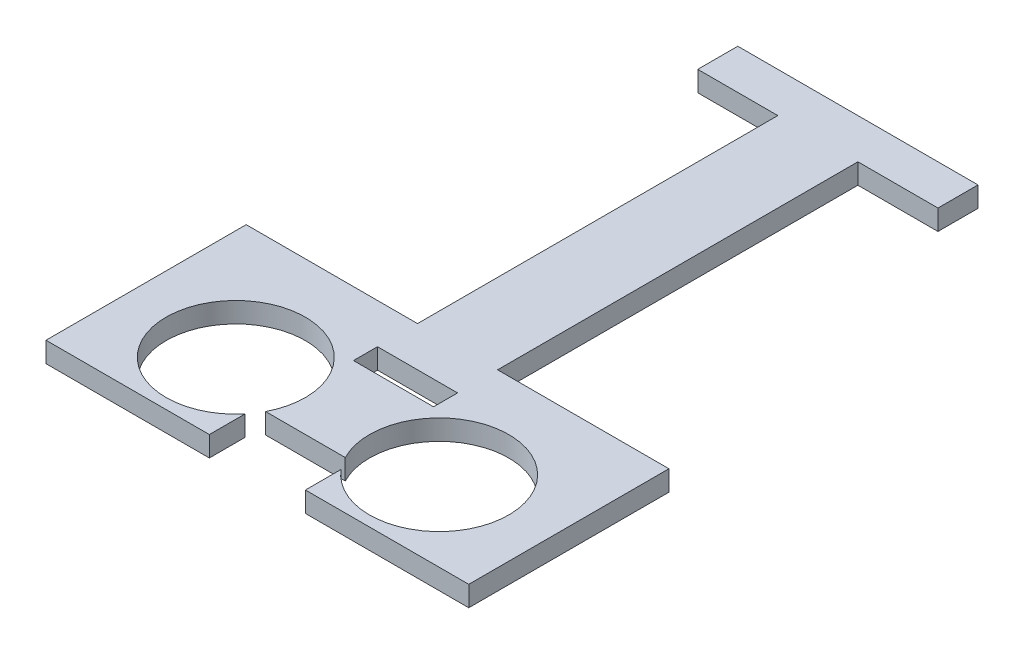
ISO-10303-21;
HEADER;
FILE_DESCRIPTION(('STEP AP214'),'2;1');
FILE_NAME('part.step','',(''),(''),'','','');
FILE_SCHEMA(('AUTOMOTIVE_DESIGN { 1 0 10303 214 1 1 1 1 }'));
ENDSEC;
DATA;
#1=APPLICATION_CONTEXT('core data for automotive mechanical design processes');
#2=APPLICATION_PROTOCOL_DEFINITION('international standard','automotive_design',2000,#1);
#3=PRODUCT_CONTEXT('',#1,'mechanical');
#4=PRODUCT('Part','Part','',(#3));
#5=PRODUCT_RELATED_PRODUCT_CATEGORY('part','',(#4));
#6=PRODUCT_DEFINITION_FORMATION('','',#4);
#7=PRODUCT_DEFINITION_CONTEXT('part definition',#1,'design');
#8=PRODUCT_DEFINITION('design','',#6,#7);
#9=PRODUCT_DEFINITION_SHAPE('','',#8);
#10=(LENGTH_UNIT() NAMED_UNIT(*) SI_UNIT(.MILLI.,.METRE.));
#11=(NAMED_UNIT(*) PLANE_ANGLE_UNIT() SI_UNIT($,.RADIAN.));
#12=(NAMED_UNIT(*) SI_UNIT($,.STERADIAN.) SOLID_ANGLE_UNIT());
#13=UNCERTAINTY_MEASURE_WITH_UNIT(LENGTH_MEASURE(1.E-05),#10,'distance_accuracy_value','');
#14=(GEOMETRIC_REPRESENTATION_CONTEXT(3) GLOBAL_UNCERTAINTY_ASSIGNED_CONTEXT((#13)) GLOBAL_UNIT_ASSIGNED_CONTEXT((#10,
#11,#12)) REPRESENTATION_CONTEXT('',''));
#15=CARTESIAN_POINT('',(0.,0.,0.));
#16=DIRECTION('',(0.,0.,1.));
#17=DIRECTION('',(1.,0.,0.));
#18=AXIS2_PLACEMENT_3D('',#15,#16,#17);
#19=CARTESIAN_POINT('',(0.,2.54,-24.8997702626595));
#20=DIRECTION('',(0.,0.,-1.));
#21=DIRECTION('',(-1.,0.,0.));
#22=AXIS2_PLACEMENT_3D('',#19,#20,#21);
#23=PLANE('',#22);
#24=DIRECTION('',(1.,0.,0.));
#25=VECTOR('',#24,1.);
#26=CARTESIAN_POINT('',(0.,0.,-24.8997702626595));
#27=LINE('',#26,#25);
#28=CARTESIAN_POINT('',(-12.7518412006876,0.,-24.8997702626595));
#29=VERTEX_POINT('',#28);
#30=CARTESIAN_POINT('',(-2.75184120068759,0.,-24.8997702626595));
#31=VERTEX_POINT('',#30);
#32=EDGE_CURVE('E248',#29,#31,#27,.T.);
#33=ORIENTED_EDGE('',*,*,#32,.T.);
#34=DIRECTION('',(0.,-1.,0.));
#35=VECTOR('',#34,1.);
#36=CARTESIAN_POINT('',(-2.75184120068759,2.54,-24.8997702626595));
#37=LINE('',#36,#35);
#38=CARTESIAN_POINT('',(-2.75184120068759,2.54,-24.8997702626595));
#39=VERTEX_POINT('',#38);
#40=EDGE_CURVE('E11',#39,#31,#37,.T.);
#41=ORIENTED_EDGE('',*,*,#40,.F.);
#42=DIRECTION('',(1.,0.,0.));
#43=VECTOR('',#42,1.);
#44=CARTESIAN_POINT('',(0.,2.54,-24.8997702626595));
#45=LINE('',#44,#43);
#46=CARTESIAN_POINT('',(-12.7518412006876,2.54,-24.8997702626595));
#47=VERTEX_POINT('',#46);
#48=EDGE_CURVE('E680',#47,#39,#45,.T.);
#49=ORIENTED_EDGE('',*,*,#48,.F.);
#50=DIRECTION('',(0.,-1.,0.));
#51=VECTOR('',#50,1.);
#52=CARTESIAN_POINT('',(-12.7518412006876,2.54,-24.8997702626595));
#53=LINE('',#52,#51);
#54=EDGE_CURVE('E61',#47,#29,#53,.T.);
#55=ORIENTED_EDGE('',*,*,#54,.T.);
#56=EDGE_LOOP('',(#33,#41,#49,#55));
#57=FACE_BOUND('',#56,.T.);
#58=ADVANCED_FACE('F41',(#57),#23,.F.);
#59=CARTESIAN_POINT('',(-2.75184120068758,2.54,0.));
#60=DIRECTION('',(1.,0.,0.));
#61=DIRECTION('',(0.,0.,-1.));
#62=AXIS2_PLACEMENT_3D('',#59,#60,#61);
#63=PLANE('',#62);
#64=DIRECTION('',(0.,0.,1.));
#65=VECTOR('',#64,1.);
#66=CARTESIAN_POINT('',(-2.75184120068758,0.,0.));
#67=LINE('',#66,#65);
#68=CARTESIAN_POINT('',(-2.75184120068758,0.,20.1002297373405));
#69=VERTEX_POINT('',#68);
#70=EDGE_CURVE('E251',#31,#69,#67,.T.);
#71=ORIENTED_EDGE('',*,*,#70,.T.);
#72=DIRECTION('',(0.,-1.,0.));
#73=VECTOR('',#72,1.);
#74=CARTESIAN_POINT('',(-2.75184120068758,2.54,20.1002297373405));
#75=LINE('',#74,#73);
#76=CARTESIAN_POINT('',(-2.75184120068758,2.54,20.1002297373405));
#77=VERTEX_POINT('',#76);
#78=EDGE_CURVE('E52',#77,#69,#75,.T.);
#79=ORIENTED_EDGE('',*,*,#78,.F.);
#80=DIRECTION('',(0.,0.,1.));
#81=VECTOR('',#80,1.);
#82=CARTESIAN_POINT('',(-2.75184120068758,2.54,0.));
#83=LINE('',#82,#81);
#84=EDGE_CURVE('E686',#39,#77,#83,.T.);
#85=ORIENTED_EDGE('',*,*,#84,.F.);
#86=ORIENTED_EDGE('',*,*,#40,.T.);
#87=EDGE_LOOP('',(#71,#79,#85,#86));
#88=FACE_BOUND('',#87,.T.);
#89=ADVANCED_FACE('F389',(#88),#63,.F.);
#90=CARTESIAN_POINT('',(0.,2.54,20.1002297373405));
#91=DIRECTION('',(0.,0.,-1.));
#92=DIRECTION('',(-1.,0.,0.));
#93=AXIS2_PLACEMENT_3D('',#90,#91,#92);
#94=PLANE('',#93);
#95=DIRECTION('',(1.,0.,0.));
#96=VECTOR('',#95,1.);
#97=CARTESIAN_POINT('',(0.,0.,20.1002297373405));
#98=LINE('',#97,#96);
#99=CARTESIAN_POINT('',(-24.1518412006876,0.,20.1002297373405));
#100=VERTEX_POINT('',#99);
#101=EDGE_CURVE('E256',#100,#69,#98,.T.);
#102=ORIENTED_EDGE('',*,*,#101,.F.);
#103=DIRECTION('',(0.,-1.,0.));
#104=VECTOR('',#103,1.);
#105=CARTESIAN_POINT('',(-24.1518412006876,2.54,20.1002297373405));
#106=LINE('',#105,#104);
#107=CARTESIAN_POINT('',(-24.1518412006876,2.54,20.1002297373405));
#108=VERTEX_POINT('',#107);
#109=EDGE_CURVE('E347',#108,#100,#106,.T.);
#110=ORIENTED_EDGE('',*,*,#109,.F.);
#111=DIRECTION('',(1.,0.,0.));
#112=VECTOR('',#111,1.);
#113=CARTESIAN_POINT('',(0.,2.54,20.1002297373405));
#114=LINE('',#113,#112);
#115=EDGE_CURVE('E651',#108,#77,#114,.T.);
#116=ORIENTED_EDGE('',*,*,#115,.T.);
#117=ORIENTED_EDGE('',*,*,#78,.T.);
#118=EDGE_LOOP('',(#102,#110,#116,#117));
#119=FACE_BOUND('',#118,.T.);
#120=ADVANCED_FACE('F395',(#119),#94,.T.);
#121=CARTESIAN_POINT('',(-24.1518412006876,2.54,0.));
#122=DIRECTION('',(1.,0.,0.));
#123=DIRECTION('',(0.,0.,-1.));
#124=AXIS2_PLACEMENT_3D('',#121,#122,#123);
#125=PLANE('',#124);
#126=DIRECTION('',(0.,0.,1.));
#127=VECTOR('',#126,1.);
#128=CARTESIAN_POINT('',(-24.1518412006876,0.,0.));
#129=LINE('',#128,#127);
#130=CARTESIAN_POINT('',(-24.1518412006876,0.,45.1002297373405));
#131=VERTEX_POINT('',#130);
#132=EDGE_CURVE('E260',#100,#131,#129,.T.);
#133=ORIENTED_EDGE('',*,*,#132,.T.);
#134=DIRECTION('',(0.,-1.,0.));
#135=VECTOR('',#134,1.);
#136=CARTESIAN_POINT('',(-24.1518412006876,2.54,45.1002297373405));
#137=LINE('',#136,#135);
#138=CARTESIAN_POINT('',(-24.1518412006876,2.54,45.1002297373405));
#139=VERTEX_POINT('',#138);
#140=EDGE_CURVE('E343',#139,#131,#137,.T.);
#141=ORIENTED_EDGE('',*,*,#140,.F.);
#142=DIRECTION('',(0.,0.,1.));
#143=VECTOR('',#142,1.);
#144=CARTESIAN_POINT('',(-24.1518412006876,2.54,0.));
#145=LINE('',#144,#143);
#146=EDGE_CURVE('E644',#108,#139,#145,.T.);
#147=ORIENTED_EDGE('',*,*,#146,.F.);
#148=ORIENTED_EDGE('',*,*,#109,.T.);
#149=EDGE_LOOP('',(#133,#141,#147,#148));
#150=FACE_BOUND('',#149,.T.);
#151=ADVANCED_FACE('F593',(#150),#125,.F.);
#152=CARTESIAN_POINT('',(0.,2.54,45.1002297373405));
#153=DIRECTION('',(0.,0.,-1.));
#154=DIRECTION('',(-1.,0.,0.));
#155=AXIS2_PLACEMENT_3D('',#152,#153,#154);
#156=PLANE('',#155);
#157=DIRECTION('',(1.,0.,0.));
#158=VECTOR('',#157,1.);
#159=CARTESIAN_POINT('',(0.,0.,45.1002297373405));
#160=LINE('',#159,#158);
#161=CARTESIAN_POINT('',(-3.75184120068757,0.,45.1002297373405));
#162=VERTEX_POINT('',#161);
#163=EDGE_CURVE('E264',#131,#162,#160,.T.);
#164=ORIENTED_EDGE('',*,*,#163,.T.);
#165=DIRECTION('',(0.,-1.,0.));
#166=VECTOR('',#165,1.);
#167=CARTESIAN_POINT('',(-3.75184120068757,2.54,45.1002297373405));
#168=LINE('',#167,#166);
#169=CARTESIAN_POINT('',(-3.75184120068757,2.54,45.1002297373405));
#170=VERTEX_POINT('',#169);
#171=EDGE_CURVE('E340',#170,#162,#168,.T.);
#172=ORIENTED_EDGE('',*,*,#171,.F.);
#173=DIRECTION('',(1.,0.,0.));
#174=VECTOR('',#173,1.);
#175=CARTESIAN_POINT('',(0.,2.54,45.1002297373405));
#176=LINE('',#175,#174);
#177=EDGE_CURVE('E639',#139,#170,#176,.T.);
#178=ORIENTED_EDGE('',*,*,#177,.F.);
#179=ORIENTED_EDGE('',*,*,#140,.T.);
#180=EDGE_LOOP('',(#164,#172,#178,#179));
#181=FACE_BOUND('',#180,.T.);
#182=ADVANCED_FACE('F536',(#181),#156,.F.);
#183=CARTESIAN_POINT('',(-3.75184120068757,2.54,0.));
#184=DIRECTION('',(1.,0.,0.));
#185=DIRECTION('',(0.,0.,-1.));
#186=AXIS2_PLACEMENT_3D('',#183,#184,#185);
#187=PLANE('',#186);
#188=DIRECTION('',(0.,0.,1.));
#189=VECTOR('',#188,1.);
#190=CARTESIAN_POINT('',(-3.75184120068757,0.,0.));
#191=LINE('',#190,#189);
#192=CARTESIAN_POINT('',(-3.75184120068757,0.,40.6500045075452));
#193=VERTEX_POINT('',#192);
#194=EDGE_CURVE('E268',#193,#162,#191,.T.);
#195=ORIENTED_EDGE('',*,*,#194,.F.);
#196=DIRECTION('',(0.,-1.,0.));
#197=VECTOR('',#196,1.);
#198=CARTESIAN_POINT('',(-3.75184120068757,2.54,40.6500045075452));
#199=LINE('',#198,#197);
#200=CARTESIAN_POINT('',(-3.75184120068757,2.54,40.6500045075452));
#201=VERTEX_POINT('',#200);
#202=EDGE_CURVE('E337',#201,#193,#199,.T.);
#203=ORIENTED_EDGE('',*,*,#202,.F.);
#204=DIRECTION('',(0.,0.,1.));
#205=VECTOR('',#204,1.);
#206=CARTESIAN_POINT('',(-3.75184120068757,2.54,0.));
#207=LINE('',#206,#205);
#208=EDGE_CURVE('E643',#201,#170,#207,.T.);
#209=ORIENTED_EDGE('',*,*,#208,.T.);
#210=ORIENTED_EDGE('',*,*,#171,.T.);
#211=EDGE_LOOP('',(#195,#203,#209,#210));
#212=FACE_BOUND('',#211,.T.);
#213=ADVANCED_FACE('F574',(#212),#187,.T.);
#214=CARTESIAN_POINT('',(-10.4518412006876,2.54,35.1002297373405));
#215=DIRECTION('',(0.,-1.,0.));
#216=DIRECTION('',(0.,0.,-1.));
#217=AXIS2_PLACEMENT_3D('',#214,#215,#216);
#218=CYLINDRICAL_SURFACE('',#217,8.7);
#219=CARTESIAN_POINT('',(-10.4518412006876,0.,35.1002297373405));
#220=DIRECTION('',(0.,1.,0.));
#221=DIRECTION('',(0.,0.,1.));
#222=AXIS2_PLACEMENT_3D('',#219,#220,#221);
#223=CIRCLE('',#222,8.7);
#224=CARTESIAN_POINT('',(-2.72591083600009,0.,39.1002297373405));
#225=VERTEX_POINT('',#224);
#226=EDGE_CURVE('E273',#225,#193,#223,.T.);
#227=ORIENTED_EDGE('',*,*,#226,.F.);
#228=DIRECTION('',(0.,-1.,0.));
#229=VECTOR('',#228,1.);
#230=CARTESIAN_POINT('',(-2.72591083600009,2.54,39.1002297373405));
#231=LINE('',#230,#229);
#232=CARTESIAN_POINT('',(-2.72591083600009,2.54,39.1002297373405));
#233=VERTEX_POINT('',#232);
#234=EDGE_CURVE('E334',#233,#225,#231,.T.);
#235=ORIENTED_EDGE('',*,*,#234,.F.);
#236=CARTESIAN_POINT('',(-10.4518412006876,2.54,35.1002297373405));
#237=DIRECTION('',(0.,1.,0.));
#238=DIRECTION('',(0.,0.,1.));
#239=AXIS2_PLACEMENT_3D('',#236,#237,#238);
#240=CIRCLE('',#239,8.7);
#241=EDGE_CURVE('E649',#233,#201,#240,.T.);
#242=ORIENTED_EDGE('',*,*,#241,.T.);
#243=ORIENTED_EDGE('',*,*,#202,.T.);
#244=EDGE_LOOP('',(#227,#235,#242,#243));
#245=FACE_BOUND('',#244,.T.);
#246=ADVANCED_FACE('F564',(#245),#218,.F.);
#247=CARTESIAN_POINT('',(0.,2.54,39.1002297373405));
#248=DIRECTION('',(0.,0.,-1.));
#249=DIRECTION('',(-1.,0.,0.));
#250=AXIS2_PLACEMENT_3D('',#247,#248,#249);
#251=PLANE('',#250);
#252=DIRECTION('',(1.,0.,0.));
#253=VECTOR('',#252,1.);
#254=CARTESIAN_POINT('',(0.,0.,39.1002297373405));
#255=LINE('',#254,#253);
#256=CARTESIAN_POINT('',(7.22222843462496,0.,39.1002297373405));
#257=VERTEX_POINT('',#256);
#258=EDGE_CURVE('E277',#225,#257,#255,.T.);
#259=ORIENTED_EDGE('',*,*,#258,.T.);
#260=DIRECTION('',(0.,-1.,0.));
#261=VECTOR('',#260,1.);
#262=CARTESIAN_POINT('',(7.22222843462496,2.54,39.1002297373405));
#263=LINE('',#262,#261);
#264=CARTESIAN_POINT('',(7.22222843462496,2.54,39.1002297373405));
#265=VERTEX_POINT('',#264);
#266=EDGE_CURVE('E331',#265,#257,#263,.T.);
#267=ORIENTED_EDGE('',*,*,#266,.F.);
#268=DIRECTION('',(1.,0.,0.));
#269=VECTOR('',#268,1.);
#270=CARTESIAN_POINT('',(0.,2.54,39.1002297373405));
#271=LINE('',#270,#269);
#272=EDGE_CURVE('E671',#233,#265,#271,.T.);
#273=ORIENTED_EDGE('',*,*,#272,.F.);
#274=ORIENTED_EDGE('',*,*,#234,.T.);
#275=EDGE_LOOP('',(#259,#267,#273,#274));
#276=FACE_BOUND('',#275,.T.);
#277=ADVANCED_FACE('F554',(#276),#251,.F.);
#278=CARTESIAN_POINT('',(14.9481587993124,2.54,35.1002297373405));
#279=DIRECTION('',(0.,-1.,0.));
#280=DIRECTION('',(0.,0.,-1.));
#281=AXIS2_PLACEMENT_3D('',#278,#279,#280);
#282=CYLINDRICAL_SURFACE('',#281,8.7);
#283=CARTESIAN_POINT('',(14.9481587993124,0.,35.1002297373405));
#284=DIRECTION('',(0.,1.,0.));
#285=DIRECTION('',(0.,0.,1.));
#286=AXIS2_PLACEMENT_3D('',#283,#284,#285);
#287=CIRCLE('',#286,8.7);
#288=CARTESIAN_POINT('',(8.24815879931243,0.,40.6500045075451));
#289=VERTEX_POINT('',#288);
#290=EDGE_CURVE('E281',#289,#257,#287,.T.);
#291=ORIENTED_EDGE('',*,*,#290,.F.);
#292=DIRECTION('',(0.,-1.,0.));
#293=VECTOR('',#292,1.);
#294=CARTESIAN_POINT('',(8.24815879931243,2.54,40.6500045075451));
#295=LINE('',#294,#293);
#296=CARTESIAN_POINT('',(8.24815879931243,2.54,40.6500045075451));
#297=VERTEX_POINT('',#296);
#298=EDGE_CURVE('E328',#297,#289,#295,.T.);
#299=ORIENTED_EDGE('',*,*,#298,.F.);
#300=CARTESIAN_POINT('',(14.9481587993124,2.54,35.1002297373405));
#301=DIRECTION('',(0.,1.,0.));
#302=DIRECTION('',(0.,0.,1.));
#303=AXIS2_PLACEMENT_3D('',#300,#301,#302);
#304=CIRCLE('',#303,8.7);
#305=EDGE_CURVE('E664',#297,#265,#304,.T.);
#306=ORIENTED_EDGE('',*,*,#305,.T.);
#307=ORIENTED_EDGE('',*,*,#266,.T.);
#308=EDGE_LOOP('',(#291,#299,#306,#307));
#309=FACE_BOUND('',#308,.T.);
#310=ADVANCED_FACE('F544',(#309),#282,.F.);
#311=CARTESIAN_POINT('',(8.24815879931243,2.54,0.));
#312=DIRECTION('',(1.,0.,0.));
#313=DIRECTION('',(0.,0.,-1.));
#314=AXIS2_PLACEMENT_3D('',#311,#312,#313);
#315=PLANE('',#314);
#316=DIRECTION('',(0.,0.,1.));
#317=VECTOR('',#316,1.);
#318=CARTESIAN_POINT('',(8.24815879931243,0.,0.));
#319=LINE('',#318,#317);
#320=CARTESIAN_POINT('',(8.24815879931243,0.,45.1002297373405));
#321=VERTEX_POINT('',#320);
#322=EDGE_CURVE('E285',#289,#321,#319,.T.);
#323=ORIENTED_EDGE('',*,*,#322,.T.);
#324=DIRECTION('',(0.,-1.,0.));
#325=VECTOR('',#324,1.);
#326=CARTESIAN_POINT('',(8.24815879931243,2.54,45.1002297373405));
#327=LINE('',#326,#325);
#328=CARTESIAN_POINT('',(8.24815879931243,2.54,45.1002297373405));
#329=VERTEX_POINT('',#328);
#330=EDGE_CURVE('E324',#329,#321,#327,.T.);
#331=ORIENTED_EDGE('',*,*,#330,.F.);
#332=DIRECTION('',(0.,0.,1.));
#333=VECTOR('',#332,1.);
#334=CARTESIAN_POINT('',(8.24815879931243,2.54,0.));
#335=LINE('',#334,#333);
#336=EDGE_CURVE('E655',#297,#329,#335,.T.);
#337=ORIENTED_EDGE('',*,*,#336,.F.);
#338=ORIENTED_EDGE('',*,*,#298,.T.);
#339=EDGE_LOOP('',(#323,#331,#337,#338));
#340=FACE_BOUND('',#339,.T.);
#341=ADVANCED_FACE('F533',(#340),#315,.F.);
#342=CARTESIAN_POINT('',(28.6481587993124,0.,45.1002297373405));
#343=VERTEX_POINT('',#342);
#344=EDGE_CURVE('E269',#321,#343,#160,.T.);
#345=ORIENTED_EDGE('',*,*,#344,.T.);
#346=DIRECTION('',(0.,-1.,0.));
#347=VECTOR('',#346,1.);
#348=CARTESIAN_POINT('',(28.6481587993124,2.54,45.1002297373405));
#349=LINE('',#348,#347);
#350=CARTESIAN_POINT('',(28.6481587993124,2.54,45.1002297373405));
#351=VERTEX_POINT('',#350);
#352=EDGE_CURVE('E321',#351,#343,#349,.T.);
#353=ORIENTED_EDGE('',*,*,#352,.F.);
#354=EDGE_CURVE('E646',#329,#351,#176,.T.);
#355=ORIENTED_EDGE('',*,*,#354,.F.);
#356=ORIENTED_EDGE('',*,*,#330,.T.);
#357=EDGE_LOOP('',(#345,#353,#355,#356));
#358=FACE_BOUND('',#357,.T.);
#359=ADVANCED_FACE('F523',(#358),#156,.F.);
#360=CARTESIAN_POINT('',(28.6481587993124,2.54,0.));
#361=DIRECTION('',(1.,0.,0.));
#362=DIRECTION('',(0.,0.,-1.));
#363=AXIS2_PLACEMENT_3D('',#360,#361,#362);
#364=PLANE('',#363);
#365=DIRECTION('',(0.,0.,1.));
#366=VECTOR('',#365,1.);
#367=CARTESIAN_POINT('',(28.6481587993124,0.,0.));
#368=LINE('',#367,#366);
#369=CARTESIAN_POINT('',(28.6481587993124,0.,20.1002297373405));
#370=VERTEX_POINT('',#369);
#371=EDGE_CURVE('E288',#370,#343,#368,.T.);
#372=ORIENTED_EDGE('',*,*,#371,.F.);
#373=DIRECTION('',(0.,-1.,0.));
#374=VECTOR('',#373,1.);
#375=CARTESIAN_POINT('',(28.6481587993124,2.54,20.1002297373405));
#376=LINE('',#375,#374);
#377=CARTESIAN_POINT('',(28.6481587993124,2.54,20.1002297373405));
#378=VERTEX_POINT('',#377);
#379=EDGE_CURVE('E318',#378,#370,#376,.T.);
#380=ORIENTED_EDGE('',*,*,#379,.F.);
#381=DIRECTION('',(0.,0.,1.));
#382=VECTOR('',#381,1.);
#383=CARTESIAN_POINT('',(28.6481587993124,2.54,0.));
#384=LINE('',#383,#382);
#385=EDGE_CURVE('E654',#378,#351,#384,.T.);
#386=ORIENTED_EDGE('',*,*,#385,.T.);
#387=ORIENTED_EDGE('',*,*,#352,.T.);
#388=EDGE_LOOP('',(#372,#380,#386,#387));
#389=FACE_BOUND('',#388,.T.);
#390=ADVANCED_FACE('F512',(#389),#364,.T.);
#391=CARTESIAN_POINT('',(7.24815879931242,0.,20.1002297373405));
#392=VERTEX_POINT('',#391);
#393=EDGE_CURVE('E261',#392,#370,#98,.T.);
#394=ORIENTED_EDGE('',*,*,#393,.F.);
#395=DIRECTION('',(0.,-1.,0.));
#396=VECTOR('',#395,1.);
#397=CARTESIAN_POINT('',(7.24815879931242,2.54,20.1002297373405));
#398=LINE('',#397,#396);
#399=CARTESIAN_POINT('',(7.24815879931242,2.54,20.1002297373405));
#400=VERTEX_POINT('',#399);
#401=EDGE_CURVE('E315',#400,#392,#398,.T.);
#402=ORIENTED_EDGE('',*,*,#401,.F.);
#403=EDGE_CURVE('E662',#400,#378,#114,.T.);
#404=ORIENTED_EDGE('',*,*,#403,.T.);
#405=ORIENTED_EDGE('',*,*,#379,.T.);
#406=EDGE_LOOP('',(#394,#402,#404,#405));
#407=FACE_BOUND('',#406,.T.);
#408=ADVANCED_FACE('F407',(#407),#94,.T.);
#409=CARTESIAN_POINT('',(7.24815879931242,2.54,0.));
#410=DIRECTION('',(1.,0.,0.));
#411=DIRECTION('',(0.,0.,-1.));
#412=AXIS2_PLACEMENT_3D('',#409,#410,#411);
#413=PLANE('',#412);
#414=DIRECTION('',(0.,0.,1.));
#415=VECTOR('',#414,1.);
#416=CARTESIAN_POINT('',(7.24815879931242,0.,0.));
#417=LINE('',#416,#415);
#418=CARTESIAN_POINT('',(7.24815879931241,0.,-24.8997702626595));
#419=VERTEX_POINT('',#418);
#420=EDGE_CURVE('E292',#419,#392,#417,.T.);
#421=ORIENTED_EDGE('',*,*,#420,.F.);
#422=DIRECTION('',(0.,-1.,0.));
#423=VECTOR('',#422,1.);
#424=CARTESIAN_POINT('',(7.24815879931241,2.54,-24.8997702626595));
#425=LINE('',#424,#423);
#426=CARTESIAN_POINT('',(7.24815879931241,2.54,-24.8997702626595));
#427=VERTEX_POINT('',#426);
#428=EDGE_CURVE('E312',#427,#419,#425,.T.);
#429=ORIENTED_EDGE('',*,*,#428,.F.);
#430=DIRECTION('',(0.,0.,1.));
#431=VECTOR('',#430,1.);
#432=CARTESIAN_POINT('',(7.24815879931242,2.54,0.));
#433=LINE('',#432,#431);
#434=EDGE_CURVE('E674',#427,#400,#433,.T.);
#435=ORIENTED_EDGE('',*,*,#434,.T.);
#436=ORIENTED_EDGE('',*,*,#401,.T.);
#437=EDGE_LOOP('',(#421,#429,#435,#436));
#438=FACE_BOUND('',#437,.T.);
#439=ADVANCED_FACE('F401',(#438),#413,.T.);
#440=CARTESIAN_POINT('',(17.2481587993124,0.,-24.8997702626595));
#441=VERTEX_POINT('',#440);
#442=EDGE_CURVE('E252',#419,#441,#27,.T.);
#443=ORIENTED_EDGE('',*,*,#442,.T.);
#444=DIRECTION('',(0.,-1.,0.));
#445=VECTOR('',#444,1.);
#446=CARTESIAN_POINT('',(17.2481587993124,2.54,-24.8997702626595));
#447=LINE('',#446,#445);
#448=CARTESIAN_POINT('',(17.2481587993124,2.54,-24.8997702626595));
#449=VERTEX_POINT('',#448);
#450=EDGE_CURVE('E222',#449,#441,#447,.T.);
#451=ORIENTED_EDGE('',*,*,#450,.F.);
#452=EDGE_CURVE('E208',#427,#449,#45,.T.);
#453=ORIENTED_EDGE('',*,*,#452,.F.);
#454=ORIENTED_EDGE('',*,*,#428,.T.);
#455=EDGE_LOOP('',(#443,#451,#453,#454));
#456=FACE_BOUND('',#455,.T.);
#457=ADVANCED_FACE('F391',(#456),#23,.F.);
#458=CARTESIAN_POINT('',(17.2481587993124,2.54,0.));
#459=DIRECTION('',(-1.,0.,0.));
#460=DIRECTION('',(0.,0.,1.));
#461=AXIS2_PLACEMENT_3D('',#458,#459,#460);
#462=PLANE('',#461);
#463=DIRECTION('',(0.,0.,-1.));
#464=VECTOR('',#463,1.);
#465=CARTESIAN_POINT('',(17.2481587993124,0.,0.));
#466=LINE('',#465,#464);
#467=CARTESIAN_POINT('',(17.2481587993124,0.,-29.8997702626595));
#468=VERTEX_POINT('',#467);
#469=EDGE_CURVE('E218',#441,#468,#466,.T.);
#470=ORIENTED_EDGE('',*,*,#469,.T.);
#471=DIRECTION('',(0.,-1.,0.));
#472=VECTOR('',#471,1.);
#473=CARTESIAN_POINT('',(17.2481587993124,2.54,-29.8997702626595));
#474=LINE('',#473,#472);
#475=CARTESIAN_POINT('',(17.2481587993124,2.54,-29.8997702626595));
#476=VERTEX_POINT('',#475);
#477=EDGE_CURVE('E215',#476,#468,#474,.T.);
#478=ORIENTED_EDGE('',*,*,#477,.F.);
#479=DIRECTION('',(0.,0.,-1.));
#480=VECTOR('',#479,1.);
#481=CARTESIAN_POINT('',(17.2481587993124,2.54,0.));
#482=LINE('',#481,#480);
#483=EDGE_CURVE('E199',#449,#476,#482,.T.);
#484=ORIENTED_EDGE('',*,*,#483,.F.);
#485=ORIENTED_EDGE('',*,*,#450,.T.);
#486=EDGE_LOOP('',(#470,#478,#484,#485));
#487=FACE_BOUND('',#486,.T.);
#488=ADVANCED_FACE('F216',(#487),#462,.F.);
#489=CARTESIAN_POINT('',(0.,2.54,-29.8997702626595));
#490=DIRECTION('',(0.,0.,-1.));
#491=DIRECTION('',(-1.,0.,0.));
#492=AXIS2_PLACEMENT_3D('',#489,#490,#491);
#493=PLANE('',#492);
#494=DIRECTION('',(1.,0.,0.));
#495=VECTOR('',#494,1.);
#496=CARTESIAN_POINT('',(0.,0.,-29.8997702626595));
#497=LINE('',#496,#495);
#498=CARTESIAN_POINT('',(-12.7518412006876,0.,-29.8997702626595));
#499=VERTEX_POINT('',#498);
#500=EDGE_CURVE('E298',#499,#468,#497,.T.);
#501=ORIENTED_EDGE('',*,*,#500,.F.);
#502=DIRECTION('',(0.,-1.,0.));
#503=VECTOR('',#502,1.);
#504=CARTESIAN_POINT('',(-12.7518412006876,2.54,-29.8997702626595));
#505=LINE('',#504,#503);
#506=CARTESIAN_POINT('',(-12.7518412006876,2.54,-29.8997702626595));
#507=VERTEX_POINT('',#506);
#508=EDGE_CURVE('E129',#507,#499,#505,.T.);
#509=ORIENTED_EDGE('',*,*,#508,.F.);
#510=DIRECTION('',(1.,0.,0.));
#511=VECTOR('',#510,1.);
#512=CARTESIAN_POINT('',(0.,2.54,-29.8997702626595));
#513=LINE('',#512,#511);
#514=EDGE_CURVE('E205',#507,#476,#513,.T.);
#515=ORIENTED_EDGE('',*,*,#514,.T.);
#516=ORIENTED_EDGE('',*,*,#477,.T.);
#517=EDGE_LOOP('',(#501,#509,#515,#516));
#518=FACE_BOUND('',#517,.T.);
#519=ADVANCED_FACE('F224',(#518),#493,.T.);
#520=CARTESIAN_POINT('',(-2.75184120068764,2.54,0.));
#521=DIRECTION('',(1.,0.,0.));
#522=DIRECTION('',(0.,0.,-1.));
#523=AXIS2_PLACEMENT_3D('',#520,#521,#522);
#524=PLANE('',#523);
#525=DIRECTION('',(0.,0.,1.));
#526=VECTOR('',#525,1.);
#527=CARTESIAN_POINT('',(-2.75184120068764,0.,0.));
#528=LINE('',#527,#526);
#529=CARTESIAN_POINT('',(-2.75184120068758,0.,25.1002297373405));
#530=VERTEX_POINT('',#529);
#531=CARTESIAN_POINT('',(-2.75184120068758,0.,28.1002297373405));
#532=VERTEX_POINT('',#531);
#533=EDGE_CURVE('E233',#530,#532,#528,.T.);
#534=ORIENTED_EDGE('',*,*,#533,.F.);
#535=DIRECTION('',(0.,-1.,0.));
#536=VECTOR('',#535,1.);
#537=CARTESIAN_POINT('',(-2.75184120068758,2.54,25.1002297373405));
#538=LINE('',#537,#536);
#539=CARTESIAN_POINT('',(-2.75184120068758,2.54,25.1002297373405));
#540=VERTEX_POINT('',#539);
#541=EDGE_CURVE('E45',#540,#530,#538,.T.);
#542=ORIENTED_EDGE('',*,*,#541,.F.);
#543=DIRECTION('',(0.,0.,1.));
#544=VECTOR('',#543,1.);
#545=CARTESIAN_POINT('',(-2.75184120068764,2.54,0.));
#546=LINE('',#545,#544);
#547=CARTESIAN_POINT('',(-2.75184120068758,2.54,28.1002297373405));
#548=VERTEX_POINT('',#547);
#549=EDGE_CURVE('E305',#540,#548,#546,.T.);
#550=ORIENTED_EDGE('',*,*,#549,.T.);
#551=DIRECTION('',(0.,-1.,0.));
#552=VECTOR('',#551,1.);
#553=CARTESIAN_POINT('',(-2.75184120068758,2.54,28.1002297373405));
#554=LINE('',#553,#552);
#555=EDGE_CURVE('E229',#548,#532,#554,.T.);
#556=ORIENTED_EDGE('',*,*,#555,.T.);
#557=EDGE_LOOP('',(#534,#542,#550,#556));
#558=FACE_BOUND('',#557,.T.);
#559=ADVANCED_FACE('F43',(#558),#524,.T.);
#560=CARTESIAN_POINT('',(0.,2.54,25.1002297373405));
#561=DIRECTION('',(0.,0.,-1.));
#562=DIRECTION('',(-1.,0.,0.));
#563=AXIS2_PLACEMENT_3D('',#560,#561,#562);
#564=PLANE('',#563);
#565=DIRECTION('',(1.,0.,0.));
#566=VECTOR('',#565,1.);
#567=CARTESIAN_POINT('',(0.,0.,25.1002297373405));
#568=LINE('',#567,#566);
#569=CARTESIAN_POINT('',(7.24815879931243,0.,25.1002297373405));
#570=VERTEX_POINT('',#569);
#571=EDGE_CURVE('E237',#530,#570,#568,.T.);
#572=ORIENTED_EDGE('',*,*,#571,.T.);
#573=DIRECTION('',(0.,-1.,0.));
#574=VECTOR('',#573,1.);
#575=CARTESIAN_POINT('',(7.24815879931243,2.54,25.1002297373405));
#576=LINE('',#575,#574);
#577=CARTESIAN_POINT('',(7.24815879931243,2.54,25.1002297373405));
#578=VERTEX_POINT('',#577);
#579=EDGE_CURVE('E356',#578,#570,#576,.T.);
#580=ORIENTED_EDGE('',*,*,#579,.F.);
#581=DIRECTION('',(1.,0.,0.));
#582=VECTOR('',#581,1.);
#583=CARTESIAN_POINT('',(0.,2.54,25.1002297373405));
#584=LINE('',#583,#582);
#585=EDGE_CURVE('E367',#540,#578,#584,.T.);
#586=ORIENTED_EDGE('',*,*,#585,.F.);
#587=ORIENTED_EDGE('',*,*,#541,.T.);
#588=EDGE_LOOP('',(#572,#580,#586,#587));
#589=FACE_BOUND('',#588,.T.);
#590=ADVANCED_FACE('F366',(#589),#564,.F.);
#591=CARTESIAN_POINT('',(7.24815879931244,2.54,0.));
#592=DIRECTION('',(1.,0.,0.));
#593=DIRECTION('',(0.,0.,-1.));
#594=AXIS2_PLACEMENT_3D('',#591,#592,#593);
#595=PLANE('',#594);
#596=DIRECTION('',(0.,0.,1.));
#597=VECTOR('',#596,1.);
#598=CARTESIAN_POINT('',(7.24815879931244,0.,0.));
#599=LINE('',#598,#597);
#600=CARTESIAN_POINT('',(7.24815879931242,0.,28.1002297373405));
#601=VERTEX_POINT('',#600);
#602=EDGE_CURVE('E240',#570,#601,#599,.T.);
#603=ORIENTED_EDGE('',*,*,#602,.T.);
#604=DIRECTION('',(0.,-1.,0.));
#605=VECTOR('',#604,1.);
#606=CARTESIAN_POINT('',(7.24815879931242,2.54,28.1002297373405));
#607=LINE('',#606,#605);
#608=CARTESIAN_POINT('',(7.24815879931242,2.54,28.1002297373405));
#609=VERTEX_POINT('',#608);
#610=EDGE_CURVE('E354',#609,#601,#607,.T.);
#611=ORIENTED_EDGE('',*,*,#610,.F.);
#612=DIRECTION('',(0.,0.,1.));
#613=VECTOR('',#612,1.);
#614=CARTESIAN_POINT('',(7.24815879931244,2.54,0.));
#615=LINE('',#614,#613);
#616=EDGE_CURVE('E693',#578,#609,#615,.T.);
#617=ORIENTED_EDGE('',*,*,#616,.F.);
#618=ORIENTED_EDGE('',*,*,#579,.T.);
#619=EDGE_LOOP('',(#603,#611,#617,#618));
#620=FACE_BOUND('',#619,.T.);
#621=ADVANCED_FACE('F379',(#620),#595,.F.);
#622=CARTESIAN_POINT('',(0.,2.54,28.1002297373405));
#623=DIRECTION('',(0.,0.,-1.));
#624=DIRECTION('',(-1.,0.,0.));
#625=AXIS2_PLACEMENT_3D('',#622,#623,#624);
#626=PLANE('',#625);
#627=DIRECTION('',(1.,0.,0.));
#628=VECTOR('',#627,1.);
#629=CARTESIAN_POINT('',(0.,0.,28.1002297373405));
#630=LINE('',#629,#628);
#631=EDGE_CURVE('E244',#532,#601,#630,.T.);
#632=ORIENTED_EDGE('',*,*,#631,.F.);
#633=ORIENTED_EDGE('',*,*,#555,.F.);
#634=DIRECTION('',(1.,0.,0.));
#635=VECTOR('',#634,1.);
#636=CARTESIAN_POINT('',(0.,2.54,28.1002297373405));
#637=LINE('',#636,#635);
#638=EDGE_CURVE('E377',#548,#609,#637,.T.);
#639=ORIENTED_EDGE('',*,*,#638,.T.);
#640=ORIENTED_EDGE('',*,*,#610,.T.);
#641=EDGE_LOOP('',(#632,#633,#639,#640));
#642=FACE_BOUND('',#641,.T.);
#643=ADVANCED_FACE('F376',(#642),#626,.T.);
#644=CARTESIAN_POINT('',(-12.7518412006876,2.54,0.));
#645=DIRECTION('',(-1.,0.,0.));
#646=DIRECTION('',(0.,0.,1.));
#647=AXIS2_PLACEMENT_3D('',#644,#645,#646);
#648=PLANE('',#647);
#649=DIRECTION('',(0.,0.,-1.));
#650=VECTOR('',#649,1.);
#651=CARTESIAN_POINT('',(-12.7518412006876,0.,0.));
#652=LINE('',#651,#650);
#653=EDGE_CURVE('E301',#29,#499,#652,.T.);
#654=ORIENTED_EDGE('',*,*,#653,.F.);
#655=ORIENTED_EDGE('',*,*,#54,.F.);
#656=DIRECTION('',(0.,0.,-1.));
#657=VECTOR('',#656,1.);
#658=CARTESIAN_POINT('',(-12.7518412006876,2.54,0.));
#659=LINE('',#658,#657);
#660=EDGE_CURVE('E226',#47,#507,#659,.T.);
#661=ORIENTED_EDGE('',*,*,#660,.T.);
#662=ORIENTED_EDGE('',*,*,#508,.T.);
#663=EDGE_LOOP('',(#654,#655,#661,#662));
#664=FACE_BOUND('',#663,.T.);
#665=ADVANCED_FACE('F386',(#664),#648,.T.);
#666=CARTESIAN_POINT('',(0.,2.54,0.));
#667=DIRECTION('',(0.,1.,0.));
#668=DIRECTION('',(0.,0.,1.));
#669=AXIS2_PLACEMENT_3D('',#666,#667,#668);
#670=PLANE('',#669);
#671=ORIENTED_EDGE('',*,*,#549,.F.);
#672=ORIENTED_EDGE('',*,*,#585,.T.);
#673=ORIENTED_EDGE('',*,*,#616,.T.);
#674=ORIENTED_EDGE('',*,*,#638,.F.);
#675=EDGE_LOOP('',(#671,#672,#673,#674));
#676=FACE_BOUND('',#675,.T.);
#677=ORIENTED_EDGE('',*,*,#48,.T.);
#678=ORIENTED_EDGE('',*,*,#84,.T.);
#679=ORIENTED_EDGE('',*,*,#115,.F.);
#680=ORIENTED_EDGE('',*,*,#146,.T.);
#681=ORIENTED_EDGE('',*,*,#177,.T.);
#682=ORIENTED_EDGE('',*,*,#208,.F.);
#683=ORIENTED_EDGE('',*,*,#241,.F.);
#684=ORIENTED_EDGE('',*,*,#272,.T.);
#685=ORIENTED_EDGE('',*,*,#305,.F.);
#686=ORIENTED_EDGE('',*,*,#336,.T.);
#687=ORIENTED_EDGE('',*,*,#354,.T.);
#688=ORIENTED_EDGE('',*,*,#385,.F.);
#689=ORIENTED_EDGE('',*,*,#403,.F.);
#690=ORIENTED_EDGE('',*,*,#434,.F.);
#691=ORIENTED_EDGE('',*,*,#452,.T.);
#692=ORIENTED_EDGE('',*,*,#483,.T.);
#693=ORIENTED_EDGE('',*,*,#514,.F.);
#694=ORIENTED_EDGE('',*,*,#660,.F.);
#695=EDGE_LOOP('',(#677,#678,#679,#680,#681,#682,#683,#684,#685,#686,#687,#688,#689,#690,#691,
#692,#693,#694));
#696=FACE_BOUND('',#695,.T.);
#697=ADVANCED_FACE('F202',(#676,#696),#670,.T.);
#698=CARTESIAN_POINT('',(0.,0.,0.));
#699=DIRECTION('',(0.,1.,0.));
#700=DIRECTION('',(0.,0.,1.));
#701=AXIS2_PLACEMENT_3D('',#698,#699,#700);
#702=PLANE('',#701);
#703=ORIENTED_EDGE('',*,*,#533,.T.);
#704=ORIENTED_EDGE('',*,*,#631,.T.);
#705=ORIENTED_EDGE('',*,*,#602,.F.);
#706=ORIENTED_EDGE('',*,*,#571,.F.);
#707=EDGE_LOOP('',(#703,#704,#705,#706));
#708=FACE_BOUND('',#707,.T.);
#709=ORIENTED_EDGE('',*,*,#32,.F.);
#710=ORIENTED_EDGE('',*,*,#653,.T.);
#711=ORIENTED_EDGE('',*,*,#500,.T.);
#712=ORIENTED_EDGE('',*,*,#469,.F.);
#713=ORIENTED_EDGE('',*,*,#442,.F.);
#714=ORIENTED_EDGE('',*,*,#420,.T.);
#715=ORIENTED_EDGE('',*,*,#393,.T.);
#716=ORIENTED_EDGE('',*,*,#371,.T.);
#717=ORIENTED_EDGE('',*,*,#344,.F.);
#718=ORIENTED_EDGE('',*,*,#322,.F.);
#719=ORIENTED_EDGE('',*,*,#290,.T.);
#720=ORIENTED_EDGE('',*,*,#258,.F.);
#721=ORIENTED_EDGE('',*,*,#226,.T.);
#722=ORIENTED_EDGE('',*,*,#194,.T.);
#723=ORIENTED_EDGE('',*,*,#163,.F.);
#724=ORIENTED_EDGE('',*,*,#132,.F.);
#725=ORIENTED_EDGE('',*,*,#101,.T.);
#726=ORIENTED_EDGE('',*,*,#70,.F.);
#727=EDGE_LOOP('',(#709,#710,#711,#712,#713,#714,#715,#716,#717,#718,#719,#720,#721,#722,#723,
#724,#725,#726));
#728=FACE_BOUND('',#727,.T.);
#729=ADVANCED_FACE('F370',(#708,#728),#702,.F.);
#730=CLOSED_SHELL('',(#58,#89,#120,#151,#182,#213,#246,#277,#310,#341,#359,#390,#408,#439,#457,
#488,#519,#559,#590,#621,#643,#665,#697,#729));
#731=MANIFOLD_SOLID_BREP('B2',#730);
#732=ADVANCED_BREP_SHAPE_REPRESENTATION('',(#18,#731),#14);
#733=SHAPE_DEFINITION_REPRESENTATION(#9,#732);
ENDSEC;
END-ISO-10303-21;
